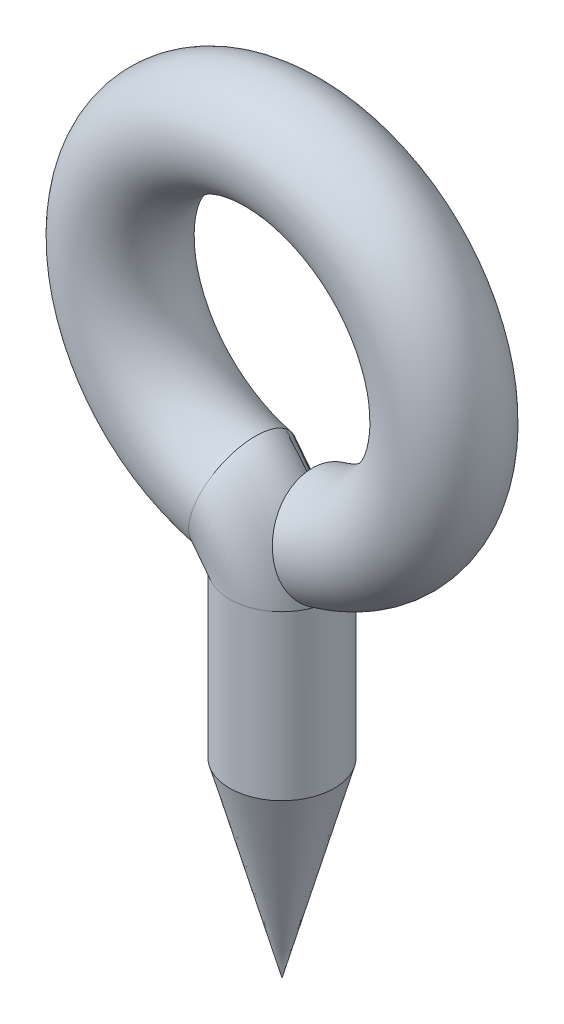
ISO-10303-21;
HEADER;
FILE_DESCRIPTION(('STEP AP214'),'2;1');
FILE_NAME('part.step','',(''),(''),'','','');
FILE_SCHEMA(('AUTOMOTIVE_DESIGN { 1 0 10303 214 1 1 1 1 }'));
ENDSEC;
DATA;
#1=APPLICATION_CONTEXT('core data for automotive mechanical design processes');
#2=APPLICATION_PROTOCOL_DEFINITION('international standard','automotive_design',2000,#1);
#3=PRODUCT_CONTEXT('',#1,'mechanical');
#4=PRODUCT('Part','Part','',(#3));
#5=PRODUCT_RELATED_PRODUCT_CATEGORY('part','',(#4));
#6=PRODUCT_DEFINITION_FORMATION('','',#4);
#7=PRODUCT_DEFINITION_CONTEXT('part definition',#1,'design');
#8=PRODUCT_DEFINITION('design','',#6,#7);
#9=PRODUCT_DEFINITION_SHAPE('','',#8);
#10=(LENGTH_UNIT() NAMED_UNIT(*) SI_UNIT(.MILLI.,.METRE.));
#11=(NAMED_UNIT(*) PLANE_ANGLE_UNIT() SI_UNIT($,.RADIAN.));
#12=(NAMED_UNIT(*) SI_UNIT($,.STERADIAN.) SOLID_ANGLE_UNIT());
#13=UNCERTAINTY_MEASURE_WITH_UNIT(LENGTH_MEASURE(1.E-05),#10,'distance_accuracy_value','');
#14=(GEOMETRIC_REPRESENTATION_CONTEXT(3) GLOBAL_UNCERTAINTY_ASSIGNED_CONTEXT((#13)) GLOBAL_UNIT_ASSIGNED_CONTEXT((#10,
#11,#12)) REPRESENTATION_CONTEXT('',''));
#15=CARTESIAN_POINT('',(0.,0.,0.));
#16=DIRECTION('',(0.,0.,1.));
#17=DIRECTION('',(1.,0.,0.));
#18=AXIS2_PLACEMENT_3D('',#15,#16,#17);
#19=CARTESIAN_POINT('',(0.,11.8,0.));
#20=DIRECTION('',(0.,0.,-1.));
#21=DIRECTION('',(-1.,0.,0.));
#22=AXIS2_PLACEMENT_3D('',#19,#20,#21);
#23=TOROIDAL_SURFACE('',#22,3.4,1.1);
#24=CARTESIAN_POINT('',(0.93716700977774,8.5317102338097,0.));
#25=DIRECTION('',(-0.961261695938324,-0.275637355816982,0.));
#26=DIRECTION('',(0.,0.,1.));
#27=AXIS2_PLACEMENT_3D('',#24,#25,#26);
#28=CIRCLE('',#27,1.1);
#29=CARTESIAN_POINT('',(0.93716700977774,8.5317102338097,1.1));
#30=VERTEX_POINT('',#29);
#31=EDGE_CURVE('E11',#30,#30,#28,.T.);
#32=ORIENTED_EDGE('',*,*,#31,.F.);
#33=EDGE_LOOP('',(#32));
#34=FACE_BOUND('',#33,.T.);
#35=CARTESIAN_POINT('',(-0.831111111111111,8.50314478313232,0.));
#36=DIRECTION('',(-0.96966329907873,0.244444444444445,0.));
#37=DIRECTION('',(0.,0.,1.));
#38=AXIS2_PLACEMENT_3D('',#35,#36,#37);
#39=CIRCLE('',#38,1.1);
#40=CARTESIAN_POINT('',(-1.1,7.43651515414571,0.));
#41=VERTEX_POINT('',#40);
#42=EDGE_CURVE('E33',#41,#41,#39,.T.);
#43=ORIENTED_EDGE('',*,*,#42,.T.);
#44=EDGE_LOOP('',(#43));
#45=FACE_BOUND('',#44,.T.);
#46=ADVANCED_FACE('F26',(#34,#45),#23,.T.);
#47=CARTESIAN_POINT('',(-1.1,7.43651515414571,0.));
#48=DIRECTION('',(0.,0.,1.));
#49=DIRECTION('',(1.,0.,0.));
#50=AXIS2_PLACEMENT_3D('',#47,#48,#49);
#51=DEGENERATE_TOROIDAL_SURFACE('',#50,1.1,1.1,.T.);
#52=CARTESIAN_POINT('',(0.,7.43651515414571,0.));
#53=DIRECTION('',(0.,1.,0.));
#54=DIRECTION('',(0.,0.,1.));
#55=AXIS2_PLACEMENT_3D('',#52,#53,#54);
#56=CIRCLE('',#55,1.1);
#57=EDGE_CURVE('E50',#41,#41,#56,.T.);
#58=ORIENTED_EDGE('',*,*,#57,.T.);
#59=ORIENTED_EDGE('',*,*,#42,.F.);
#60=EDGE_LOOP('',(#58,#59));
#61=FACE_BOUND('',#60,.T.);
#62=ADVANCED_FACE('F55',(#61),#51,.T.);
#63=CARTESIAN_POINT('',(0.,7.43651515414571,0.));
#64=DIRECTION('',(0.,-1.,0.));
#65=DIRECTION('',(0.,0.,-1.));
#66=AXIS2_PLACEMENT_3D('',#63,#64,#65);
#67=CYLINDRICAL_SURFACE('',#66,1.1);
#68=ORIENTED_EDGE('',*,*,#57,.F.);
#69=EDGE_LOOP('',(#68));
#70=FACE_BOUND('',#69,.T.);
#71=CARTESIAN_POINT('',(0.,4.,0.));
#72=DIRECTION('',(0.,1.,0.));
#73=DIRECTION('',(0.,0.,1.));
#74=AXIS2_PLACEMENT_3D('',#71,#72,#73);
#75=CIRCLE('',#74,1.1);
#76=CARTESIAN_POINT('',(0.,4.,1.1));
#77=VERTEX_POINT('',#76);
#78=EDGE_CURVE('E48',#77,#77,#75,.T.);
#79=ORIENTED_EDGE('',*,*,#78,.T.);
#80=EDGE_LOOP('',(#79));
#81=FACE_BOUND('',#80,.T.);
#82=ADVANCED_FACE('F57',(#70,#81),#67,.T.);
#83=CARTESIAN_POINT('',(0.93716700977774,8.5317102338097,0.));
#84=DIRECTION('',(-0.961261695938324,-0.275637355816982,0.));
#85=DIRECTION('',(0.,0.,1.));
#86=AXIS2_PLACEMENT_3D('',#83,#84,#85);
#87=PLANE('',#86);
#88=ORIENTED_EDGE('',*,*,#31,.T.);
#89=EDGE_LOOP('',(#88));
#90=FACE_BOUND('',#89,.T.);
#91=ADVANCED_FACE('F44',(#90),#87,.T.);
#92=CARTESIAN_POINT('',(0.,4.,0.));
#93=DIRECTION('',(0.,1.,0.));
#94=DIRECTION('',(0.,0.,1.));
#95=AXIS2_PLACEMENT_3D('',#92,#93,#94);
#96=CONICAL_SURFACE('',#95,1.1,0.268366210905907);
#97=CARTESIAN_POINT('',(0.,0.,0.));
#98=VERTEX_POINT('',#97);
#99=VERTEX_LOOP('',#98);
#100=FACE_BOUND('',#99,.T.);
#101=ORIENTED_EDGE('',*,*,#78,.F.);
#102=EDGE_LOOP('',(#101));
#103=FACE_BOUND('',#102,.T.);
#104=ADVANCED_FACE('F41',(#100,#103),#96,.T.);
#105=CLOSED_SHELL('',(#46,#62,#82,#91,#104));
#106=MANIFOLD_SOLID_BREP('B2',#105);
#107=ADVANCED_BREP_SHAPE_REPRESENTATION('',(#18,#106),#14);
#108=SHAPE_DEFINITION_REPRESENTATION(#9,#107);
ENDSEC;
END-ISO-10303-21;
